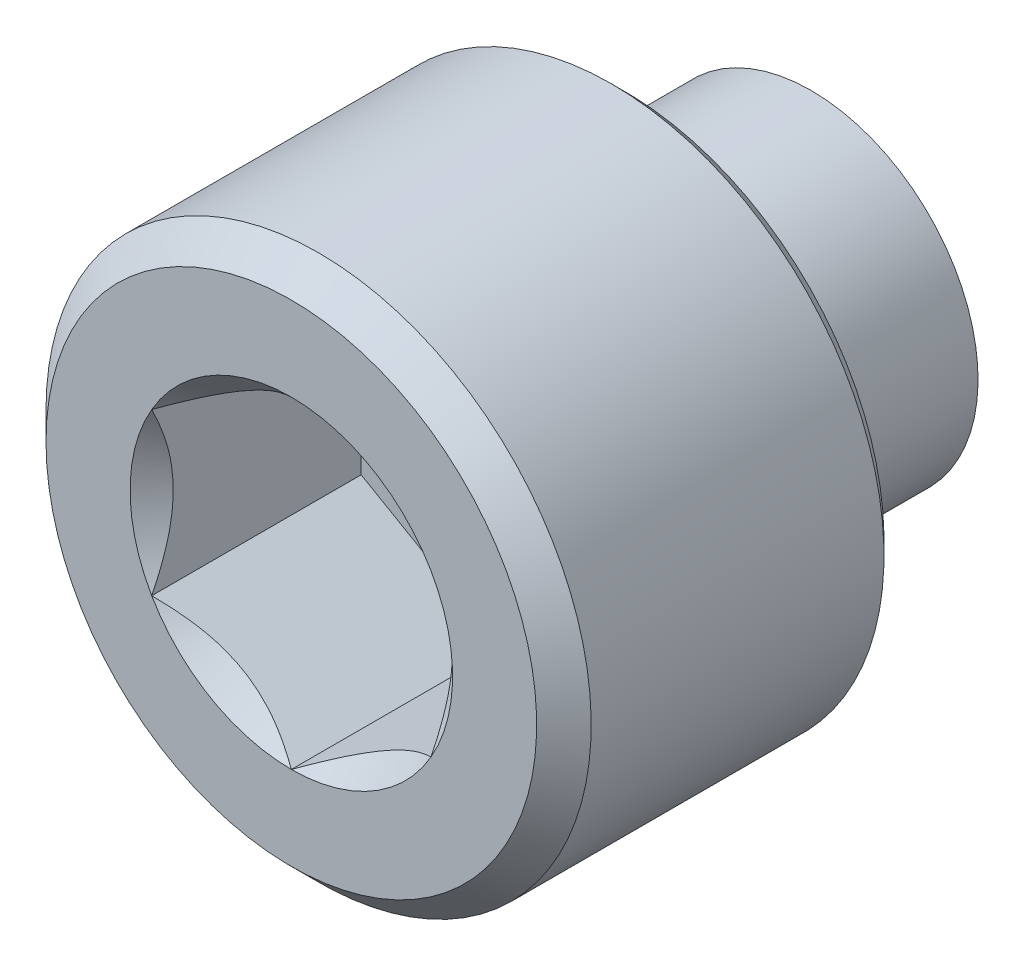
ISO-10303-21;
HEADER;
FILE_DESCRIPTION(('STEP AP214'),'2;1');
FILE_NAME('part.step','',(''),(''),'','','');
FILE_SCHEMA(('AUTOMOTIVE_DESIGN { 1 0 10303 214 1 1 1 1 }'));
ENDSEC;
DATA;
#1=APPLICATION_CONTEXT('core data for automotive mechanical design processes');
#2=APPLICATION_PROTOCOL_DEFINITION('international standard','automotive_design',2000,#1);
#3=PRODUCT_CONTEXT('',#1,'mechanical');
#4=PRODUCT('Part','Part','',(#3));
#5=PRODUCT_RELATED_PRODUCT_CATEGORY('part','',(#4));
#6=PRODUCT_DEFINITION_FORMATION('','',#4);
#7=PRODUCT_DEFINITION_CONTEXT('part definition',#1,'design');
#8=PRODUCT_DEFINITION('design','',#6,#7);
#9=PRODUCT_DEFINITION_SHAPE('','',#8);
#10=(LENGTH_UNIT() NAMED_UNIT(*) SI_UNIT(.MILLI.,.METRE.));
#11=(NAMED_UNIT(*) PLANE_ANGLE_UNIT() SI_UNIT($,.RADIAN.));
#12=(NAMED_UNIT(*) SI_UNIT($,.STERADIAN.) SOLID_ANGLE_UNIT());
#13=UNCERTAINTY_MEASURE_WITH_UNIT(LENGTH_MEASURE(1.E-05),#10,'distance_accuracy_value','');
#14=(GEOMETRIC_REPRESENTATION_CONTEXT(3) GLOBAL_UNCERTAINTY_ASSIGNED_CONTEXT((#13)) GLOBAL_UNIT_ASSIGNED_CONTEXT((#10,
#11,#12)) REPRESENTATION_CONTEXT('',''));
#15=CARTESIAN_POINT('',(0.,0.,0.));
#16=DIRECTION('',(0.,0.,1.));
#17=DIRECTION('',(1.,0.,0.));
#18=AXIS2_PLACEMENT_3D('',#15,#16,#17);
#19=CARTESIAN_POINT('',(0.,1.3748153285078,1.0588625));
#20=DIRECTION('',(-0.5,0.866025403784439,0.));
#21=DIRECTION('',(-0.866025403784439,-0.5,0.));
#22=AXIS2_PLACEMENT_3D('',#19,#20,#21);
#23=PLANE('',#22);
#24=CARTESIAN_POINT('',(-1.1906250000066,0.687407664250086,2.84479999998502));
#25=CARTESIAN_POINT('',(-1.14970263916698,0.711034200296719,2.82119613531504));
#26=CARTESIAN_POINT('',(-1.10809605277407,0.735055774150727,2.79897879634496));
#27=CARTESIAN_POINT('',(-1.02325595337692,0.784038228375746,2.75829979728824));
#28=CARTESIAN_POINT('',(-0.980014376483598,0.809003764435288,2.73986076358822));
#29=CARTESIAN_POINT('',(-0.892819863396888,0.859345540037758,2.7082745706127));
#30=CARTESIAN_POINT('',(-0.84888912095941,0.884708966009736,2.69504804213692));
#31=CARTESIAN_POINT('',(-0.760060747152767,0.935994051538678,2.67467007140398));
#32=CARTESIAN_POINT('',(-0.715165827467328,0.961914145504313,2.66750342341367));
#33=CARTESIAN_POINT('',(-0.637785345269698,1.00658978773114,2.66103686839825));
#34=CARTESIAN_POINT('',(-0.605399644683398,1.02528768068253,2.66007994961073));
#35=CARTESIAN_POINT('',(-0.54068524850732,1.06265055473523,2.6616947291032));
#36=CARTESIAN_POINT('',(-0.50835656708912,1.08131552765458,2.6642672068447));
#37=CARTESIAN_POINT('',(-0.444011323014485,1.11846527164214,2.67279207143155));
#38=CARTESIAN_POINT('',(-0.411995078793013,1.13694985886185,2.67874760121189));
#39=CARTESIAN_POINT('',(-0.34849713862346,1.17361041171173,2.6937178209893));
#40=CARTESIAN_POINT('',(-0.317015678145004,1.19178624139345,2.70273382366176));
#41=CARTESIAN_POINT('',(-0.236423425587406,1.23831620010217,2.72947923567867));
#42=CARTESIAN_POINT('',(-0.187819783695696,1.26637752583195,2.74921600103918));
#43=CARTESIAN_POINT('',(-0.0925140444349895,1.32140232004943,2.79367313920624));
#44=CARTESIAN_POINT('',(-0.0458063370526902,1.34836902747983,2.81837728916578));
#45=CARTESIAN_POINT('',(6.6039952147484E-12,1.37481532851161,2.84479999998502));
#46=B_SPLINE_CURVE_WITH_KNOTS('',3,(#24,#25,#26,#27,#28,#29,#30,#31,#32,#33,#34,#35,#36,#37,#38,
#39,#40,#41,#42,#43,#44,#45),.UNSPECIFIED.,.F.,.F.,(4,2,2,2,2,2,2,2,2,2,4),(0.,
0.158570945742088,0.318065397747242,0.475027617148486,0.631594800914074,0.743660160556868,
0.855750273637264,0.967944691778625,1.08018729245194,1.25836291026262,1.43596581390407),.UNSPECIFIED.);
#47=CARTESIAN_POINT('',(-1.19062500000866,0.687407664252709,2.84479999998812));
#48=VERTEX_POINT('',#47);
#49=CARTESIAN_POINT('',(-5.36009764917085E-12,1.3748153285147,2.84479999998812));
#50=VERTEX_POINT('',#49);
#51=EDGE_CURVE('E20',#48,#50,#46,.T.);
#52=ORIENTED_EDGE('',*,*,#51,.F.);
#53=DIRECTION('',(0.,0.,1.));
#54=VECTOR('',#53,1.);
#55=CARTESIAN_POINT('',(-1.190625,0.687407664253898,1.0588625));
#56=LINE('',#55,#54);
#57=CARTESIAN_POINT('',(-1.190625,0.687407664253898,1.0588625));
#58=VERTEX_POINT('',#57);
#59=EDGE_CURVE('E103',#48,#58,#56,.F.);
#60=ORIENTED_EDGE('',*,*,#59,.T.);
#61=DIRECTION('',(-0.866025403784439,-0.5,0.));
#62=VECTOR('',#61,1.);
#63=CARTESIAN_POINT('',(0.,1.3748153285078,1.0588625));
#64=LINE('',#63,#62);
#65=CARTESIAN_POINT('',(0.,1.3748153285078,1.0588625));
#66=VERTEX_POINT('',#65);
#67=EDGE_CURVE('E76',#66,#58,#64,.T.);
#68=ORIENTED_EDGE('',*,*,#67,.F.);
#69=DIRECTION('',(0.,0.,1.));
#70=VECTOR('',#69,1.);
#71=CARTESIAN_POINT('',(0.,1.3748153285078,1.0588625));
#72=LINE('',#71,#70);
#73=EDGE_CURVE('E75',#66,#50,#72,.T.);
#74=ORIENTED_EDGE('',*,*,#73,.T.);
#75=EDGE_LOOP('',(#52,#60,#68,#74));
#76=FACE_BOUND('',#75,.T.);
#77=ADVANCED_FACE('F16',(#76),#23,.F.);
#78=CARTESIAN_POINT('',(1.190625,0.687407664253898,1.0588625));
#79=DIRECTION('',(0.5,0.866025403784439,0.));
#80=DIRECTION('',(-0.866025403784439,0.5,0.));
#81=AXIS2_PLACEMENT_3D('',#78,#79,#80);
#82=PLANE('',#81);
#83=CARTESIAN_POINT('',(-6.60258188229841E-12,1.37481532851161,2.84479999998502));
#84=CARTESIAN_POINT('',(0.0409223608330234,1.35118879246497,2.82119613531503));
#85=CARTESIAN_POINT('',(0.0825289472259331,1.32716721861097,2.79897879634496));
#86=CARTESIAN_POINT('',(0.167369046623083,1.27818476438595,2.75829979728824));
#87=CARTESIAN_POINT('',(0.210610623516402,1.25321922832641,2.73986076358822));
#88=CARTESIAN_POINT('',(0.297805136603112,1.20287745272394,2.7082745706127));
#89=CARTESIAN_POINT('',(0.341735879040589,1.17751402675196,2.69504804213692));
#90=CARTESIAN_POINT('',(0.430564252847232,1.12622894122302,2.67467007140398));
#91=CARTESIAN_POINT('',(0.475459172532671,1.10030884725738,2.66750342341367));
#92=CARTESIAN_POINT('',(0.552839654730301,1.05563320503056,2.66103686839825));
#93=CARTESIAN_POINT('',(0.585225355316601,1.03693531207916,2.66007994961073));
#94=CARTESIAN_POINT('',(0.649939751492678,0.99957243802646,2.6616947291032));
#95=CARTESIAN_POINT('',(0.682268432910878,0.980907465107116,2.6642672068447));
#96=CARTESIAN_POINT('',(0.746613676985514,0.943757721119553,2.67279207143155));
#97=CARTESIAN_POINT('',(0.778629921206986,0.925273133899846,2.67874760121189));
#98=CARTESIAN_POINT('',(0.842127861376539,0.888612581049967,2.6937178209893));
#99=CARTESIAN_POINT('',(0.873609321854995,0.870436751368248,2.70273382366176));
#100=CARTESIAN_POINT('',(0.954201574412593,0.823906792659521,2.72947923567867));
#101=CARTESIAN_POINT('',(1.0028052163043,0.795845466929746,2.74921600103918));
#102=CARTESIAN_POINT('',(1.09811095556501,0.740820672712261,2.79367313920624));
#103=CARTESIAN_POINT('',(1.14481866294731,0.71385396528186,2.81837728916578));
#104=CARTESIAN_POINT('',(1.1906250000066,0.687407664250086,2.84479999998502));
#105=B_SPLINE_CURVE_WITH_KNOTS('',3,(#83,#84,#85,#86,#87,#88,#89,#90,#91,#92,#93,#94,#95,#96,
#97,#98,#99,#100,#101,#102,#103,#104),.UNSPECIFIED.,.F.,.F.,(4,2,2,2,2,2,2,2,2,2,4),(0.,
0.158570945742087,0.318065397747241,0.475027617148484,0.631594800914072,0.743660160556865,
0.855750273637262,0.967944691778623,1.08018729245194,1.25836291026262,1.43596581390407),.UNSPECIFIED.);
#106=CARTESIAN_POINT('',(1.1906250000033,0.687407664261994,2.84479999998812));
#107=VERTEX_POINT('',#106);
#108=EDGE_CURVE('E83',#50,#107,#105,.T.);
#109=ORIENTED_EDGE('',*,*,#108,.F.);
#110=ORIENTED_EDGE('',*,*,#73,.F.);
#111=DIRECTION('',(-0.866025403784439,0.5,0.));
#112=VECTOR('',#111,1.);
#113=CARTESIAN_POINT('',(1.190625,0.687407664253898,1.0588625));
#114=LINE('',#113,#112);
#115=CARTESIAN_POINT('',(1.190625,0.687407664253898,1.0588625));
#116=VERTEX_POINT('',#115);
#117=EDGE_CURVE('E274',#116,#66,#114,.T.);
#118=ORIENTED_EDGE('',*,*,#117,.F.);
#119=DIRECTION('',(0.,0.,-1.));
#120=VECTOR('',#119,1.);
#121=CARTESIAN_POINT('',(1.190625,0.687407664253898,1.0588625));
#122=LINE('',#121,#120);
#123=EDGE_CURVE('E102',#116,#107,#122,.F.);
#124=ORIENTED_EDGE('',*,*,#123,.T.);
#125=EDGE_LOOP('',(#109,#110,#118,#124));
#126=FACE_BOUND('',#125,.T.);
#127=ADVANCED_FACE('F100',(#126),#82,.F.);
#128=CARTESIAN_POINT('',(-1.190625,0.687407664253898,1.0588625));
#129=DIRECTION('',(-1.,0.,0.));
#130=DIRECTION('',(0.,0.,1.));
#131=AXIS2_PLACEMENT_3D('',#128,#129,#130);
#132=PLANE('',#131);
#133=CARTESIAN_POINT('',(-1.190625,-0.687407664261521,2.84479999998502));
#134=CARTESIAN_POINT('',(-1.190625,-0.640154592155733,2.82119613531601));
#135=CARTESIAN_POINT('',(-1.190625,-0.59211144443512,2.79897879634742));
#136=CARTESIAN_POINT('',(-1.190625,-0.494146535959898,2.75829979729507));
#137=CARTESIAN_POINT('',(-1.190625,-0.44421546382823,2.73986076359793));
#138=CARTESIAN_POINT('',(-1.190625,-0.343531912598787,2.70827457062987));
#139=CARTESIAN_POINT('',(-1.190625,-0.292805060642917,2.69504804215862));
#140=CARTESIAN_POINT('',(-1.190625,-0.190234889561814,2.67467007143631));
#141=CARTESIAN_POINT('',(-1.190625,-0.138394701619237,2.66750342345211));
#142=CARTESIAN_POINT('',(-1.190625,-0.0490434171393793,2.66103686844754));
#143=CARTESIAN_POINT('',(-1.190625,-0.0116476312214196,2.66007994966522));
#144=CARTESIAN_POINT('',(-1.190625,0.0630781169137559,2.66169472916976));
#145=CARTESIAN_POINT('',(-1.190625,0.100408062767044,2.66426720691813));
#146=CARTESIAN_POINT('',(-1.190625,0.174707550770708,2.67279207151994));
#147=CARTESIAN_POINT('',(-1.190625,0.211676725224058,2.67874760130838));
#148=CARTESIAN_POINT('',(-1.190625,0.28499783095106,2.69371782110269));
#149=CARTESIAN_POINT('',(-1.190625,0.321349490327807,2.70273382378395));
#150=CARTESIAN_POINT('',(-1.190625,0.414409407701242,2.72947923580167));
#151=CARTESIAN_POINT('',(-1.190625,0.470532059105747,2.74921600114536));
#152=CARTESIAN_POINT('',(-1.190625,0.580581647435257,2.79367313926687));
#153=CARTESIAN_POINT('',(-1.190625,0.634515062245639,2.81837728919768));
#154=CARTESIAN_POINT('',(-1.190625,0.687407664261522,2.84479999998502));
#155=B_SPLINE_CURVE_WITH_KNOTS('',3,(#133,#134,#135,#136,#137,#138,#139,#140,#141,#142,#143,
#144,#145,#146,#147,#148,#149,#150,#151,#152,#153,#154),.UNSPECIFIED.,.F.,.F.,(4,2,2,2,2,2,2,2,
2,2,4),(0.,0.158570945774428,0.318065397811932,0.475027617244226,0.63159480104084,
0.743660160728622,0.855750273854062,0.967944692040523,1.08018729275895,1.25836291039832,
1.43596581386788),.UNSPECIFIED.);
#156=CARTESIAN_POINT('',(-1.1906250000033,-0.687407664261993,2.84479999998812));
#157=VERTEX_POINT('',#156);
#158=EDGE_CURVE('E60',#157,#48,#155,.T.);
#159=ORIENTED_EDGE('',*,*,#158,.F.);
#160=DIRECTION('',(0.,0.,1.));
#161=VECTOR('',#160,1.);
#162=CARTESIAN_POINT('',(-1.190625,-0.687407664253897,1.0588625));
#163=LINE('',#162,#161);
#164=CARTESIAN_POINT('',(-1.190625,-0.687407664253897,1.0588625));
#165=VERTEX_POINT('',#164);
#166=EDGE_CURVE('E251',#157,#165,#163,.F.);
#167=ORIENTED_EDGE('',*,*,#166,.T.);
#168=DIRECTION('',(0.,-1.,0.));
#169=VECTOR('',#168,1.);
#170=CARTESIAN_POINT('',(-1.190625,-2.06222299276169,1.0588625));
#171=LINE('',#170,#169);
#172=EDGE_CURVE('E270',#58,#165,#171,.T.);
#173=ORIENTED_EDGE('',*,*,#172,.F.);
#174=ORIENTED_EDGE('',*,*,#59,.F.);
#175=EDGE_LOOP('',(#159,#167,#173,#174));
#176=FACE_BOUND('',#175,.T.);
#177=ADVANCED_FACE('F121',(#176),#132,.F.);
#178=CARTESIAN_POINT('',(1.190625,-2.06222299276169,1.0588625));
#179=DIRECTION('',(0.,0.,1.));
#180=DIRECTION('',(0.,-1.,0.));
#181=AXIS2_PLACEMENT_3D('',#178,#179,#180);
#182=PLANE('',#181);
#183=ORIENTED_EDGE('',*,*,#67,.T.);
#184=ORIENTED_EDGE('',*,*,#172,.T.);
#185=DIRECTION('',(0.866025403784439,-0.5,0.));
#186=VECTOR('',#185,1.);
#187=CARTESIAN_POINT('',(-1.190625,-0.687407664253898,1.0588625));
#188=LINE('',#187,#186);
#189=CARTESIAN_POINT('',(0.,-1.3748153285078,1.0588625));
#190=VERTEX_POINT('',#189);
#191=EDGE_CURVE('E143',#165,#190,#188,.T.);
#192=ORIENTED_EDGE('',*,*,#191,.T.);
#193=DIRECTION('',(0.866025403784439,0.5,0.));
#194=VECTOR('',#193,1.);
#195=CARTESIAN_POINT('',(0.,-1.3748153285078,1.0588625));
#196=LINE('',#195,#194);
#197=CARTESIAN_POINT('',(1.190625,-0.687407664253898,1.0588625));
#198=VERTEX_POINT('',#197);
#199=EDGE_CURVE('E241',#190,#198,#196,.T.);
#200=ORIENTED_EDGE('',*,*,#199,.T.);
#201=DIRECTION('',(0.,1.,0.));
#202=VECTOR('',#201,1.);
#203=CARTESIAN_POINT('',(1.190625,-0.687407664253898,1.0588625));
#204=LINE('',#203,#202);
#205=EDGE_CURVE('E265',#198,#116,#204,.T.);
#206=ORIENTED_EDGE('',*,*,#205,.T.);
#207=ORIENTED_EDGE('',*,*,#117,.T.);
#208=EDGE_LOOP('',(#183,#184,#192,#200,#206,#207));
#209=FACE_BOUND('',#208,.T.);
#210=ADVANCED_FACE('F125',(#209),#182,.T.);
#211=CARTESIAN_POINT('',(1.190625,-0.687407664253898,1.0588625));
#212=DIRECTION('',(1.,0.,0.));
#213=DIRECTION('',(0.,0.,-1.));
#214=AXIS2_PLACEMENT_3D('',#211,#212,#213);
#215=PLANE('',#214);
#216=CARTESIAN_POINT('',(1.190625,0.687407664261522,2.84479999998502));
#217=CARTESIAN_POINT('',(1.190625,0.640154592155734,2.82119613531601));
#218=CARTESIAN_POINT('',(1.190625,0.592111444435121,2.79897879634742));
#219=CARTESIAN_POINT('',(1.190625,0.494146535959899,2.75829979729507));
#220=CARTESIAN_POINT('',(1.190625,0.444215463828231,2.73986076359793));
#221=CARTESIAN_POINT('',(1.190625,0.343531912598788,2.70827457062987));
#222=CARTESIAN_POINT('',(1.190625,0.292805060642918,2.69504804215862));
#223=CARTESIAN_POINT('',(1.190625,0.190234889561815,2.67467007143631));
#224=CARTESIAN_POINT('',(1.190625,0.138394701619238,2.66750342345211));
#225=CARTESIAN_POINT('',(1.190625,0.0490434171393802,2.66103686844754));
#226=CARTESIAN_POINT('',(1.190625,0.0116476312214205,2.66007994966522));
#227=CARTESIAN_POINT('',(1.190625,-0.063078116913755,2.66169472916976));
#228=CARTESIAN_POINT('',(1.190625,-0.100408062767043,2.66426720691813));
#229=CARTESIAN_POINT('',(1.190625,-0.174707550770707,2.67279207151994));
#230=CARTESIAN_POINT('',(1.190625,-0.211676725224057,2.67874760130838));
#231=CARTESIAN_POINT('',(1.190625,-0.284997830951059,2.69371782110269));
#232=CARTESIAN_POINT('',(1.190625,-0.321349490327806,2.70273382378395));
#233=CARTESIAN_POINT('',(1.190625,-0.414409407701251,2.72947923580168));
#234=CARTESIAN_POINT('',(1.190625,-0.470532059105765,2.74921600114537));
#235=CARTESIAN_POINT('',(1.190625,-0.580581647435293,2.79367313926689));
#236=CARTESIAN_POINT('',(1.190625,-0.634515062245684,2.8183772891977));
#237=CARTESIAN_POINT('',(1.190625,-0.687407664261576,2.84479999998505));
#238=B_SPLINE_CURVE_WITH_KNOTS('',3,(#216,#217,#218,#219,#220,#221,#222,#223,#224,#225,#226,
#227,#228,#229,#230,#231,#232,#233,#234,#235,#236,#237),.UNSPECIFIED.,.F.,.F.,(4,2,2,2,2,2,2,2,
2,2,4),(0.,0.158570945774428,0.318065397811933,0.475027617244227,0.631594801040841,
0.743660160728623,0.855750273854062,0.967944692040524,1.08018729275895,1.25836291039835,
1.43596581386794),.UNSPECIFIED.);
#239=CARTESIAN_POINT('',(1.19062500000433,-0.687407664256398,2.84479999998621));
#240=VERTEX_POINT('',#239);
#241=EDGE_CURVE('E39',#107,#240,#238,.T.);
#242=ORIENTED_EDGE('',*,*,#241,.F.);
#243=ORIENTED_EDGE('',*,*,#123,.F.);
#244=ORIENTED_EDGE('',*,*,#205,.F.);
#245=DIRECTION('',(0.,0.,1.));
#246=VECTOR('',#245,1.);
#247=CARTESIAN_POINT('',(1.190625,-0.687407664253898,1.0588625));
#248=LINE('',#247,#246);
#249=EDGE_CURVE('E236',#198,#240,#248,.T.);
#250=ORIENTED_EDGE('',*,*,#249,.T.);
#251=EDGE_LOOP('',(#242,#243,#244,#250));
#252=FACE_BOUND('',#251,.T.);
#253=ADVANCED_FACE('F129',(#252),#215,.F.);
#254=CARTESIAN_POINT('',(-1.190625,-0.687407664253898,1.0588625));
#255=DIRECTION('',(-0.5,-0.866025403784439,0.));
#256=DIRECTION('',(0.866025403784439,-0.5,0.));
#257=AXIS2_PLACEMENT_3D('',#254,#255,#256);
#258=PLANE('',#257);
#259=CARTESIAN_POINT('',(6.64987203329574E-12,-1.37481532851163,2.84479999998505));
#260=CARTESIAN_POINT('',(-0.040922360832979,-1.351188792465,2.82119613531506));
#261=CARTESIAN_POINT('',(-0.0825289472258917,-1.32716721861099,2.79897879634498));
#262=CARTESIAN_POINT('',(-0.167369046623048,-1.27818476438597,2.75829979728826));
#263=CARTESIAN_POINT('',(-0.21061062351637,-1.25321922832642,2.73986076358823));
#264=CARTESIAN_POINT('',(-0.297805136603086,-1.20287745272395,2.70827457061271));
#265=CARTESIAN_POINT('',(-0.341735879040568,-1.17751402675197,2.69504804213693));
#266=CARTESIAN_POINT('',(-0.430564252847217,-1.12622894122302,2.67467007140398));
#267=CARTESIAN_POINT('',(-0.47545917253266,-1.10030884725739,2.66750342341367));
#268=CARTESIAN_POINT('',(-0.552839654730294,-1.05563320503056,2.66103686839825));
#269=CARTESIAN_POINT('',(-0.585225355316594,-1.03693531207917,2.66007994961073));
#270=CARTESIAN_POINT('',(-0.649939751492672,-0.999572438026463,2.6616947291032));
#271=CARTESIAN_POINT('',(-0.682268432910872,-0.98090746510712,2.6642672068447));
#272=CARTESIAN_POINT('',(-0.746613676985508,-0.943757721119556,2.67279207143155));
#273=CARTESIAN_POINT('',(-0.778629921206979,-0.925273133899849,2.67874760121189));
#274=CARTESIAN_POINT('',(-0.842127861376534,-0.88861258104997,2.6937178209893));
#275=CARTESIAN_POINT('',(-0.873609321854989,-0.870436751368251,2.70273382366176));
#276=CARTESIAN_POINT('',(-0.954201574412589,-0.823906792659523,2.72947923567867));
#277=CARTESIAN_POINT('',(-1.0028052163043,-0.795845466929748,2.74921600103917));
#278=CARTESIAN_POINT('',(-1.09811095556501,-0.740820672712261,2.79367313920624));
#279=CARTESIAN_POINT('',(-1.14481866294731,-0.71385396528186,2.81837728916578));
#280=CARTESIAN_POINT('',(-1.1906250000066,-0.687407664250085,2.84479999998502));
#281=B_SPLINE_CURVE_WITH_KNOTS('',3,(#259,#260,#261,#262,#263,#264,#265,#266,#267,#268,#269,
#270,#271,#272,#273,#274,#275,#276,#277,#278,#279,#280),.UNSPECIFIED.,.F.,.F.,(4,2,2,2,2,2,2,2,
2,2,4),(0.,0.1585709457421,0.318065397747268,0.475027617148524,0.631594800914124,
0.743660160556919,0.855750273637315,0.967944691778677,1.08018729245199,1.25836291026268,
1.43596581390413),.UNSPECIFIED.);
#282=CARTESIAN_POINT('',(-5.33687621898403E-12,-1.37481532851472,2.84479999998813));
#283=VERTEX_POINT('',#282);
#284=EDGE_CURVE('E144',#283,#157,#281,.T.);
#285=ORIENTED_EDGE('',*,*,#284,.F.);
#286=DIRECTION('',(0.,0.,1.));
#287=VECTOR('',#286,1.);
#288=CARTESIAN_POINT('',(0.,-1.3748153285078,1.0588625));
#289=LINE('',#288,#287);
#290=EDGE_CURVE('E234',#283,#190,#289,.F.);
#291=ORIENTED_EDGE('',*,*,#290,.T.);
#292=ORIENTED_EDGE('',*,*,#191,.F.);
#293=ORIENTED_EDGE('',*,*,#166,.F.);
#294=EDGE_LOOP('',(#285,#291,#292,#293));
#295=FACE_BOUND('',#294,.T.);
#296=ADVANCED_FACE('F134',(#295),#258,.F.);
#297=CARTESIAN_POINT('',(0.,0.,-1.5875));
#298=DIRECTION('',(0.,0.,-1.));
#299=DIRECTION('',(0.,1.,0.));
#300=AXIS2_PLACEMENT_3D('',#297,#298,#299);
#301=PLANE('',#300);
#302=CARTESIAN_POINT('',(0.,0.,-1.5875));
#303=DIRECTION('',(0.,0.,-1.));
#304=DIRECTION('',(0.,1.,0.));
#305=AXIS2_PLACEMENT_3D('',#302,#303,#304);
#306=CIRCLE('',#305,1.4224);
#307=CARTESIAN_POINT('',(0.,1.4224,-1.5875));
#308=VERTEX_POINT('',#307);
#309=EDGE_CURVE('E172',#308,#308,#306,.F.);
#310=ORIENTED_EDGE('',*,*,#309,.F.);
#311=EDGE_LOOP('',(#310));
#312=FACE_BOUND('',#311,.T.);
#313=ADVANCED_FACE('F179',(#312),#301,.T.);
#314=CARTESIAN_POINT('',(0.,-1.3748153285078,1.0588625));
#315=DIRECTION('',(0.5,-0.866025403784439,0.));
#316=DIRECTION('',(0.866025403784439,0.5,0.));
#317=AXIS2_PLACEMENT_3D('',#314,#315,#316);
#318=PLANE('',#317);
#319=CARTESIAN_POINT('',(-6.64973248529993E-12,-1.37481532851163,2.84479999998505));
#320=CARTESIAN_POINT('',(0.0409223608329791,-1.351188792465,2.82119613531506));
#321=CARTESIAN_POINT('',(0.0825289472258919,-1.32716721861099,2.79897879634498));
#322=CARTESIAN_POINT('',(0.167369046623048,-1.27818476438597,2.75829979728826));
#323=CARTESIAN_POINT('',(0.21061062351637,-1.25321922832642,2.73986076358823));
#324=CARTESIAN_POINT('',(0.297805136603086,-1.20287745272395,2.70827457061271));
#325=CARTESIAN_POINT('',(0.341735879040568,-1.17751402675197,2.69504804213693));
#326=CARTESIAN_POINT('',(0.430564252847217,-1.12622894122302,2.67467007140398));
#327=CARTESIAN_POINT('',(0.47545917253266,-1.10030884725739,2.66750342341367));
#328=CARTESIAN_POINT('',(0.552839654730294,-1.05563320503056,2.66103686839825));
#329=CARTESIAN_POINT('',(0.585225355316594,-1.03693531207917,2.66007994961073));
#330=CARTESIAN_POINT('',(0.649939751492672,-0.999572438026463,2.6616947291032));
#331=CARTESIAN_POINT('',(0.682268432910872,-0.98090746510712,2.6642672068447));
#332=CARTESIAN_POINT('',(0.746613676985508,-0.943757721119556,2.67279207143155));
#333=CARTESIAN_POINT('',(0.778629921206979,-0.925273133899849,2.67874760121189));
#334=CARTESIAN_POINT('',(0.842127861376534,-0.88861258104997,2.6937178209893));
#335=CARTESIAN_POINT('',(0.873609321854989,-0.870436751368251,2.70273382366176));
#336=CARTESIAN_POINT('',(0.954201574412597,-0.823906792659518,2.72947923567867));
#337=CARTESIAN_POINT('',(1.00280521630432,-0.795845466929738,2.74921600103918));
#338=CARTESIAN_POINT('',(1.09811095556504,-0.740820672712243,2.79367313920626));
#339=CARTESIAN_POINT('',(1.14481866294735,-0.713853965281838,2.8183772891658));
#340=CARTESIAN_POINT('',(1.19062500000665,-0.687407664250059,2.84479999998505));
#341=B_SPLINE_CURVE_WITH_KNOTS('',3,(#319,#320,#321,#322,#323,#324,#325,#326,#327,#328,#329,
#330,#331,#332,#333,#334,#335,#336,#337,#338,#339,#340),.UNSPECIFIED.,.F.,.F.,(4,2,2,2,2,2,2,2,
2,2,4),(0.,0.1585709457421,0.318065397747268,0.475027617148523,0.631594800914124,
0.743660160556918,0.855750273637315,0.967944691778677,1.08018729245199,1.25836291026271,
1.43596581390419),.UNSPECIFIED.);
#342=EDGE_CURVE('E163',#283,#240,#341,.T.);
#343=ORIENTED_EDGE('',*,*,#342,.T.);
#344=ORIENTED_EDGE('',*,*,#249,.F.);
#345=ORIENTED_EDGE('',*,*,#199,.F.);
#346=ORIENTED_EDGE('',*,*,#290,.F.);
#347=EDGE_LOOP('',(#343,#344,#345,#346));
#348=FACE_BOUND('',#347,.T.);
#349=ADVANCED_FACE('F174',(#348),#318,.F.);
#350=CARTESIAN_POINT('',(0.,0.,0.));
#351=DIRECTION('',(0.,0.,-1.));
#352=DIRECTION('',(0.,1.,0.));
#353=AXIS2_PLACEMENT_3D('',#350,#351,#352);
#354=CYLINDRICAL_SURFACE('',#353,1.4224);
#355=CARTESIAN_POINT('',(0.,0.,0.));
#356=DIRECTION('',(0.,0.,-1.));
#357=DIRECTION('',(0.,1.,0.));
#358=AXIS2_PLACEMENT_3D('',#355,#356,#357);
#359=CIRCLE('',#358,1.4224);
#360=CARTESIAN_POINT('',(0.,1.4224,0.));
#361=VERTEX_POINT('',#360);
#362=EDGE_CURVE('E171',#361,#361,#359,.T.);
#363=ORIENTED_EDGE('',*,*,#362,.T.);
#364=EDGE_LOOP('',(#363));
#365=FACE_BOUND('',#364,.T.);
#366=ORIENTED_EDGE('',*,*,#309,.T.);
#367=EDGE_LOOP('',(#366));
#368=FACE_BOUND('',#367,.T.);
#369=ADVANCED_FACE('F178',(#365,#368),#354,.T.);
#370=CARTESIAN_POINT('',(0.,0.,2.84479999999121));
#371=DIRECTION('',(0.,0.,1.));
#372=DIRECTION('',(1.,0.,0.));
#373=AXIS2_PLACEMENT_3D('',#370,#371,#372);
#374=CONICAL_SURFACE('',#373,1.3748153285178,0.785398163244065);
#375=ORIENTED_EDGE('',*,*,#284,.T.);
#376=CARTESIAN_POINT('',(0.,0.,2.84479999999121));
#377=DIRECTION('',(0.,0.,1.));
#378=DIRECTION('',(1.,0.,0.));
#379=AXIS2_PLACEMENT_3D('',#376,#377,#378);
#380=CIRCLE('',#379,1.3748153285178);
#381=EDGE_CURVE('E227',#283,#157,#380,.F.);
#382=ORIENTED_EDGE('',*,*,#381,.F.);
#383=EDGE_LOOP('',(#375,#382));
#384=FACE_BOUND('',#383,.T.);
#385=ADVANCED_FACE('F232',(#384),#374,.F.);
#386=CARTESIAN_POINT('',(0.,0.,2.84479999999121));
#387=DIRECTION('',(0.,0.,1.));
#388=DIRECTION('',(1.,0.,0.));
#389=AXIS2_PLACEMENT_3D('',#386,#387,#388);
#390=CONICAL_SURFACE('',#389,1.3748153285178,0.785398163397448);
#391=CARTESIAN_POINT('',(0.,0.,2.84479999999121));
#392=DIRECTION('',(0.,0.,1.));
#393=DIRECTION('',(1.,0.,0.));
#394=AXIS2_PLACEMENT_3D('',#391,#392,#393);
#395=CIRCLE('',#394,1.3748153285178);
#396=EDGE_CURVE('E93',#157,#48,#395,.F.);
#397=ORIENTED_EDGE('',*,*,#396,.F.);
#398=ORIENTED_EDGE('',*,*,#158,.T.);
#399=EDGE_LOOP('',(#397,#398));
#400=FACE_BOUND('',#399,.T.);
#401=ADVANCED_FACE('F300',(#400),#390,.F.);
#402=CARTESIAN_POINT('',(0.,0.,2.84479999999121));
#403=DIRECTION('',(0.,0.,1.));
#404=DIRECTION('',(1.,0.,0.));
#405=AXIS2_PLACEMENT_3D('',#402,#403,#404);
#406=CONICAL_SURFACE('',#405,1.3748153285178,0.785398163244065);
#407=ORIENTED_EDGE('',*,*,#51,.T.);
#408=CARTESIAN_POINT('',(0.,0.,2.84479999999121));
#409=DIRECTION('',(0.,0.,1.));
#410=DIRECTION('',(1.,0.,0.));
#411=AXIS2_PLACEMENT_3D('',#408,#409,#410);
#412=CIRCLE('',#411,1.3748153285178);
#413=EDGE_CURVE('E71',#48,#50,#412,.F.);
#414=ORIENTED_EDGE('',*,*,#413,.F.);
#415=EDGE_LOOP('',(#407,#414));
#416=FACE_BOUND('',#415,.T.);
#417=ADVANCED_FACE('F69',(#416),#406,.F.);
#418=CARTESIAN_POINT('',(0.,0.,2.84479999999121));
#419=DIRECTION('',(0.,0.,1.));
#420=DIRECTION('',(1.,0.,0.));
#421=AXIS2_PLACEMENT_3D('',#418,#419,#420);
#422=CONICAL_SURFACE('',#421,1.3748153285178,0.785398163244065);
#423=ORIENTED_EDGE('',*,*,#108,.T.);
#424=CARTESIAN_POINT('',(0.,0.,2.84479999999121));
#425=DIRECTION('',(0.,0.,1.));
#426=DIRECTION('',(1.,0.,0.));
#427=AXIS2_PLACEMENT_3D('',#424,#425,#426);
#428=CIRCLE('',#427,1.3748153285178);
#429=EDGE_CURVE('E91',#50,#107,#428,.F.);
#430=ORIENTED_EDGE('',*,*,#429,.F.);
#431=EDGE_LOOP('',(#423,#430));
#432=FACE_BOUND('',#431,.T.);
#433=ADVANCED_FACE('F96',(#432),#422,.F.);
#434=CARTESIAN_POINT('',(0.,0.,2.84479999999121));
#435=DIRECTION('',(0.,0.,1.));
#436=DIRECTION('',(0.,-1.,0.));
#437=AXIS2_PLACEMENT_3D('',#434,#435,#436);
#438=CONICAL_SURFACE('',#437,1.3748153285178,0.785398163397448);
#439=ORIENTED_EDGE('',*,*,#241,.T.);
#440=CARTESIAN_POINT('',(0.,0.,2.84479999999121));
#441=DIRECTION('',(0.,0.,1.));
#442=DIRECTION('',(0.,-1.,0.));
#443=AXIS2_PLACEMENT_3D('',#440,#441,#442);
#444=CIRCLE('',#443,1.3748153285178);
#445=EDGE_CURVE('E98',#107,#240,#444,.F.);
#446=ORIENTED_EDGE('',*,*,#445,.F.);
#447=EDGE_LOOP('',(#439,#446));
#448=FACE_BOUND('',#447,.T.);
#449=ADVANCED_FACE('F151',(#448),#438,.F.);
#450=CARTESIAN_POINT('',(0.,0.,2.84479999999121));
#451=DIRECTION('',(0.,0.,1.));
#452=DIRECTION('',(1.,0.,0.));
#453=AXIS2_PLACEMENT_3D('',#450,#451,#452);
#454=CONICAL_SURFACE('',#453,1.3748153285178,0.785398163244065);
#455=ORIENTED_EDGE('',*,*,#342,.F.);
#456=CARTESIAN_POINT('',(0.,0.,2.84479999999121));
#457=DIRECTION('',(0.,0.,1.));
#458=DIRECTION('',(1.,0.,0.));
#459=AXIS2_PLACEMENT_3D('',#456,#457,#458);
#460=CIRCLE('',#459,1.3748153285178);
#461=EDGE_CURVE('E218',#240,#283,#460,.F.);
#462=ORIENTED_EDGE('',*,*,#461,.F.);
#463=EDGE_LOOP('',(#455,#462));
#464=FACE_BOUND('',#463,.T.);
#465=ADVANCED_FACE('F155',(#464),#454,.F.);
#466=CARTESIAN_POINT('',(0.,0.,0.));
#467=DIRECTION('',(0.,0.,1.));
#468=DIRECTION('',(0.,-1.,0.));
#469=AXIS2_PLACEMENT_3D('',#466,#467,#468);
#470=PLANE('',#469);
#471=ORIENTED_EDGE('',*,*,#362,.F.);
#472=EDGE_LOOP('',(#471));
#473=FACE_BOUND('',#472,.T.);
#474=CARTESIAN_POINT('',(0.,0.,5.6843418860808E-11));
#475=DIRECTION('',(0.,0.,1.));
#476=DIRECTION('',(0.,-1.,0.));
#477=AXIS2_PLACEMENT_3D('',#474,#475,#476);
#478=CIRCLE('',#477,2.20789500002638);
#479=CARTESIAN_POINT('',(0.,-2.20789500002638,5.68436892337248E-11));
#480=VERTEX_POINT('',#479);
#481=EDGE_CURVE('E216',#480,#480,#478,.T.);
#482=ORIENTED_EDGE('',*,*,#481,.F.);
#483=EDGE_LOOP('',(#482));
#484=FACE_BOUND('',#483,.T.);
#485=ADVANCED_FACE('F159',(#473,#484),#470,.F.);
#486=CARTESIAN_POINT('',(0.,0.,2.8448));
#487=DIRECTION('',(0.,0.,1.));
#488=DIRECTION('',(0.,-1.,0.));
#489=AXIS2_PLACEMENT_3D('',#486,#487,#488);
#490=PLANE('',#489);
#491=ORIENTED_EDGE('',*,*,#445,.T.);
#492=ORIENTED_EDGE('',*,*,#461,.T.);
#493=ORIENTED_EDGE('',*,*,#381,.T.);
#494=ORIENTED_EDGE('',*,*,#396,.T.);
#495=ORIENTED_EDGE('',*,*,#413,.T.);
#496=ORIENTED_EDGE('',*,*,#429,.T.);
#497=EDGE_LOOP('',(#491,#492,#493,#494,#495,#496));
#498=FACE_BOUND('',#497,.T.);
#499=CARTESIAN_POINT('',(0.,0.,2.84479999999121));
#500=DIRECTION('',(0.,0.,-1.));
#501=DIRECTION('',(-1.,0.,0.));
#502=AXIS2_PLACEMENT_3D('',#499,#500,#501);
#503=CIRCLE('',#502,2.09168999992926);
#504=CARTESIAN_POINT('',(-2.09168999992926,0.,2.84479999999121));
#505=VERTEX_POINT('',#504);
#506=EDGE_CURVE('E217',#505,#505,#503,.T.);
#507=ORIENTED_EDGE('',*,*,#506,.F.);
#508=EDGE_LOOP('',(#507));
#509=FACE_BOUND('',#508,.T.);
#510=ADVANCED_FACE('F89',(#498,#509),#490,.T.);
#511=CARTESIAN_POINT('',(0.,0.,0.116204999926595));
#512=DIRECTION('',(0.,0.,1.));
#513=DIRECTION('',(0.,-1.,0.));
#514=AXIS2_PLACEMENT_3D('',#511,#512,#513);
#515=CONICAL_SURFACE('',#514,2.32409999989613,0.785398163397448);
#516=ORIENTED_EDGE('',*,*,#481,.T.);
#517=EDGE_LOOP('',(#516));
#518=FACE_BOUND('',#517,.T.);
#519=CARTESIAN_POINT('',(0.,0.,0.116205000000002));
#520=DIRECTION('',(0.,0.,-1.));
#521=DIRECTION('',(0.,1.,0.));
#522=AXIS2_PLACEMENT_3D('',#519,#520,#521);
#523=CIRCLE('',#522,2.3241);
#524=CARTESIAN_POINT('',(0.,2.3241,0.116205000000001));
#525=VERTEX_POINT('',#524);
#526=EDGE_CURVE('E31',#525,#525,#523,.F.);
#527=ORIENTED_EDGE('',*,*,#526,.F.);
#528=EDGE_LOOP('',(#527));
#529=FACE_BOUND('',#528,.T.);
#530=ADVANCED_FACE('F197',(#518,#529),#515,.T.);
#531=CARTESIAN_POINT('',(0.,0.,2.61238999996749));
#532=DIRECTION('',(0.,0.,-1.));
#533=DIRECTION('',(-1.,0.,0.));
#534=AXIS2_PLACEMENT_3D('',#531,#532,#533);
#535=CONICAL_SURFACE('',#534,2.32409999995298,0.785398163397448);
#536=ORIENTED_EDGE('',*,*,#506,.T.);
#537=EDGE_LOOP('',(#536));
#538=FACE_BOUND('',#537,.T.);
#539=CARTESIAN_POINT('',(0.,0.,2.61239));
#540=DIRECTION('',(0.,0.,-1.));
#541=DIRECTION('',(0.,1.,0.));
#542=AXIS2_PLACEMENT_3D('',#539,#540,#541);
#543=CIRCLE('',#542,2.3241);
#544=CARTESIAN_POINT('',(0.,2.3241,2.61239));
#545=VERTEX_POINT('',#544);
#546=EDGE_CURVE('E11',#545,#545,#543,.T.);
#547=ORIENTED_EDGE('',*,*,#546,.F.);
#548=EDGE_LOOP('',(#547));
#549=FACE_BOUND('',#548,.T.);
#550=ADVANCED_FACE('F191',(#538,#549),#535,.T.);
#551=CARTESIAN_POINT('',(0.,0.,2.8448));
#552=DIRECTION('',(0.,0.,-1.));
#553=DIRECTION('',(0.,1.,0.));
#554=AXIS2_PLACEMENT_3D('',#551,#552,#553);
#555=CYLINDRICAL_SURFACE('',#554,2.3241);
#556=ORIENTED_EDGE('',*,*,#546,.T.);
#557=EDGE_LOOP('',(#556));
#558=FACE_BOUND('',#557,.T.);
#559=ORIENTED_EDGE('',*,*,#526,.T.);
#560=EDGE_LOOP('',(#559));
#561=FACE_BOUND('',#560,.T.);
#562=ADVANCED_FACE('F189',(#558,#561),#555,.T.);
#563=CLOSED_SHELL('',(#77,#127,#177,#210,#253,#296,#313,#349,#369,#385,#401,#417,#433,#449,#465,
#485,#510,#530,#550,#562));
#564=MANIFOLD_SOLID_BREP('B1',#563);
#565=ADVANCED_BREP_SHAPE_REPRESENTATION('',(#18,#564),#14);
#566=SHAPE_DEFINITION_REPRESENTATION(#9,#565);
ENDSEC;
END-ISO-10303-21;
